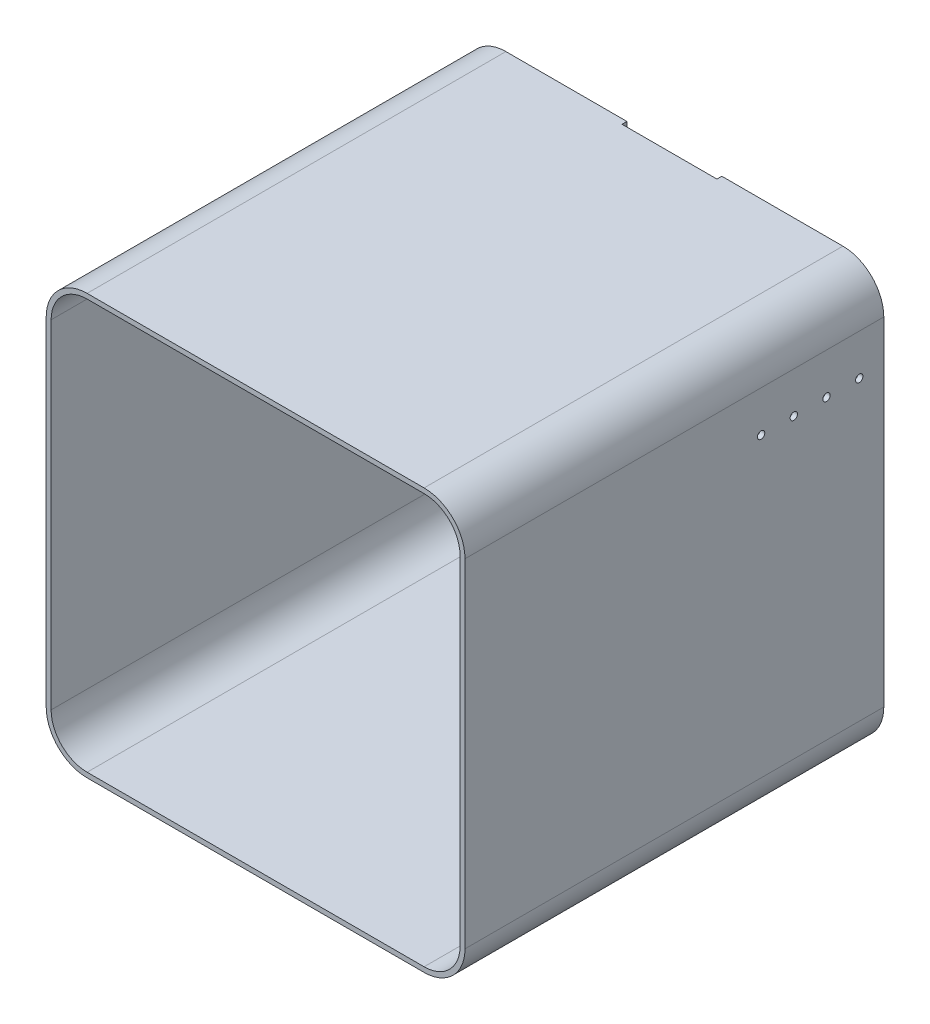
ISO-10303-21;
HEADER;
FILE_DESCRIPTION(('STEP AP214'),'2;1');
FILE_NAME('part.step','',(''),(''),'','','');
FILE_SCHEMA(('AUTOMOTIVE_DESIGN { 1 0 10303 214 1 1 1 1 }'));
ENDSEC;
DATA;
#1=APPLICATION_CONTEXT('core data for automotive mechanical design processes');
#2=APPLICATION_PROTOCOL_DEFINITION('international standard','automotive_design',2000,#1);
#3=PRODUCT_CONTEXT('',#1,'mechanical');
#4=PRODUCT('Part','Part','',(#3));
#5=PRODUCT_RELATED_PRODUCT_CATEGORY('part','',(#4));
#6=PRODUCT_DEFINITION_FORMATION('','',#4);
#7=PRODUCT_DEFINITION_CONTEXT('part definition',#1,'design');
#8=PRODUCT_DEFINITION('design','',#6,#7);
#9=PRODUCT_DEFINITION_SHAPE('','',#8);
#10=(LENGTH_UNIT() NAMED_UNIT(*) SI_UNIT(.MILLI.,.METRE.));
#11=(NAMED_UNIT(*) PLANE_ANGLE_UNIT() SI_UNIT($,.RADIAN.));
#12=(NAMED_UNIT(*) SI_UNIT($,.STERADIAN.) SOLID_ANGLE_UNIT());
#13=UNCERTAINTY_MEASURE_WITH_UNIT(LENGTH_MEASURE(1.E-05),#10,'distance_accuracy_value','');
#14=(GEOMETRIC_REPRESENTATION_CONTEXT(3) GLOBAL_UNCERTAINTY_ASSIGNED_CONTEXT((#13)) GLOBAL_UNIT_ASSIGNED_CONTEXT((#10,
#11,#12)) REPRESENTATION_CONTEXT('',''));
#15=CARTESIAN_POINT('',(0.,0.,0.));
#16=DIRECTION('',(0.,0.,1.));
#17=DIRECTION('',(1.,0.,0.));
#18=AXIS2_PLACEMENT_3D('',#15,#16,#17);
#19=CARTESIAN_POINT('',(496.,407.,-362.));
#20=DIRECTION('',(1.,0.,0.));
#21=DIRECTION('',(0.,1.,0.));
#22=AXIS2_PLACEMENT_3D('',#19,#20,#21);
#23=CYLINDRICAL_SURFACE('',#22,4.50000000000002);
#24=CARTESIAN_POINT('',(506.,407.,-362.));
#25=DIRECTION('',(1.,0.,0.));
#26=DIRECTION('',(0.,1.,0.));
#27=AXIS2_PLACEMENT_3D('',#24,#25,#26);
#28=CIRCLE('',#27,4.50000000000002);
#29=CARTESIAN_POINT('',(506.,411.5,-362.));
#30=VERTEX_POINT('',#29);
#31=EDGE_CURVE('E89',#30,#30,#28,.T.);
#32=ORIENTED_EDGE('',*,*,#31,.T.);
#33=EDGE_LOOP('',(#32));
#34=FACE_BOUND('',#33,.T.);
#35=CARTESIAN_POINT('',(500.,407.,-362.));
#36=DIRECTION('',(1.,0.,0.));
#37=DIRECTION('',(0.,1.,0.));
#38=AXIS2_PLACEMENT_3D('',#35,#36,#37);
#39=CIRCLE('',#38,4.50000000000002);
#40=CARTESIAN_POINT('',(500.,411.5,-362.));
#41=VERTEX_POINT('',#40);
#42=EDGE_CURVE('E12',#41,#41,#39,.T.);
#43=ORIENTED_EDGE('',*,*,#42,.F.);
#44=EDGE_LOOP('',(#43));
#45=FACE_BOUND('',#44,.T.);
#46=ADVANCED_FACE('F82',(#34,#45),#23,.F.);
#47=CARTESIAN_POINT('',(496.,407.,-402.));
#48=DIRECTION('',(1.,0.,0.));
#49=DIRECTION('',(0.,1.,0.));
#50=AXIS2_PLACEMENT_3D('',#47,#48,#49);
#51=CYLINDRICAL_SURFACE('',#50,4.50000000000002);
#52=CARTESIAN_POINT('',(506.,407.,-402.));
#53=DIRECTION('',(1.,0.,0.));
#54=DIRECTION('',(0.,1.,0.));
#55=AXIS2_PLACEMENT_3D('',#52,#53,#54);
#56=CIRCLE('',#55,4.50000000000002);
#57=CARTESIAN_POINT('',(506.,411.5,-402.));
#58=VERTEX_POINT('',#57);
#59=EDGE_CURVE('E378',#58,#58,#56,.T.);
#60=ORIENTED_EDGE('',*,*,#59,.T.);
#61=EDGE_LOOP('',(#60));
#62=FACE_BOUND('',#61,.T.);
#63=CARTESIAN_POINT('',(500.,407.,-402.));
#64=DIRECTION('',(1.,0.,0.));
#65=DIRECTION('',(0.,1.,0.));
#66=AXIS2_PLACEMENT_3D('',#63,#64,#65);
#67=CIRCLE('',#66,4.50000000000002);
#68=CARTESIAN_POINT('',(500.,411.5,-402.));
#69=VERTEX_POINT('',#68);
#70=EDGE_CURVE('E383',#69,#69,#67,.T.);
#71=ORIENTED_EDGE('',*,*,#70,.F.);
#72=EDGE_LOOP('',(#71));
#73=FACE_BOUND('',#72,.T.);
#74=ADVANCED_FACE('F411',(#62,#73),#51,.F.);
#75=CARTESIAN_POINT('',(44.,457.,-512.));
#76=DIRECTION('',(0.,0.,-1.));
#77=DIRECTION('',(-1.,0.,0.));
#78=AXIS2_PLACEMENT_3D('',#75,#76,#77);
#79=PLANE('',#78);
#80=DIRECTION('',(0.,-1.,0.));
#81=VECTOR('',#80,1.);
#82=CARTESIAN_POINT('',(308.,507.,-512.));
#83=LINE('',#82,#81);
#84=CARTESIAN_POINT('',(308.,507.,-512.));
#85=VERTEX_POINT('',#84);
#86=CARTESIAN_POINT('',(308.,501.,-512.));
#87=VERTEX_POINT('',#86);
#88=EDGE_CURVE('E447',#85,#87,#83,.T.);
#89=ORIENTED_EDGE('',*,*,#88,.F.);
#90=DIRECTION('',(1.,0.,0.));
#91=VECTOR('',#90,1.);
#92=CARTESIAN_POINT('',(44.,507.,-512.));
#93=LINE('',#92,#91);
#94=CARTESIAN_POINT('',(456.,507.,-512.));
#95=VERTEX_POINT('',#94);
#96=EDGE_CURVE('E322',#85,#95,#93,.T.);
#97=ORIENTED_EDGE('',*,*,#96,.T.);
#98=CARTESIAN_POINT('',(456.,457.,-512.));
#99=DIRECTION('',(0.,0.,-1.));
#100=DIRECTION('',(-1.,0.,0.));
#101=AXIS2_PLACEMENT_3D('',#98,#99,#100);
#102=CIRCLE('',#101,50.);
#103=CARTESIAN_POINT('',(506.,457.,-512.));
#104=VERTEX_POINT('',#103);
#105=EDGE_CURVE('E326',#95,#104,#102,.T.);
#106=ORIENTED_EDGE('',*,*,#105,.T.);
#107=DIRECTION('',(0.,1.,0.));
#108=VECTOR('',#107,1.);
#109=CARTESIAN_POINT('',(506.,457.,-512.));
#110=LINE('',#109,#108);
#111=CARTESIAN_POINT('',(506.,44.,-512.));
#112=VERTEX_POINT('',#111);
#113=EDGE_CURVE('E328',#112,#104,#110,.T.);
#114=ORIENTED_EDGE('',*,*,#113,.F.);
#115=CARTESIAN_POINT('',(456.,44.,-512.));
#116=DIRECTION('',(0.,0.,-1.));
#117=DIRECTION('',(-1.,0.,0.));
#118=AXIS2_PLACEMENT_3D('',#115,#116,#117);
#119=CIRCLE('',#118,50.);
#120=CARTESIAN_POINT('',(456.,-6.,-512.));
#121=VERTEX_POINT('',#120);
#122=EDGE_CURVE('E331',#121,#112,#119,.F.);
#123=ORIENTED_EDGE('',*,*,#122,.F.);
#124=DIRECTION('',(1.,0.,0.));
#125=VECTOR('',#124,1.);
#126=CARTESIAN_POINT('',(44.,-6.00000000000001,-512.));
#127=LINE('',#126,#125);
#128=CARTESIAN_POINT('',(44.,-6.,-512.));
#129=VERTEX_POINT('',#128);
#130=EDGE_CURVE('E334',#129,#121,#127,.T.);
#131=ORIENTED_EDGE('',*,*,#130,.F.);
#132=CARTESIAN_POINT('',(44.,44.,-512.));
#133=DIRECTION('',(0.,0.,-1.));
#134=DIRECTION('',(-1.,0.,0.));
#135=AXIS2_PLACEMENT_3D('',#132,#133,#134);
#136=CIRCLE('',#135,50.);
#137=CARTESIAN_POINT('',(-6.,44.,-512.));
#138=VERTEX_POINT('',#137);
#139=EDGE_CURVE('E337',#129,#138,#136,.T.);
#140=ORIENTED_EDGE('',*,*,#139,.T.);
#141=DIRECTION('',(0.,1.,0.));
#142=VECTOR('',#141,1.);
#143=CARTESIAN_POINT('',(-6.,457.,-512.));
#144=LINE('',#143,#142);
#145=CARTESIAN_POINT('',(-6.,457.,-512.));
#146=VERTEX_POINT('',#145);
#147=EDGE_CURVE('E316',#138,#146,#144,.T.);
#148=ORIENTED_EDGE('',*,*,#147,.T.);
#149=CARTESIAN_POINT('',(44.,457.,-512.));
#150=DIRECTION('',(0.,0.,-1.));
#151=DIRECTION('',(-1.,0.,0.));
#152=AXIS2_PLACEMENT_3D('',#149,#150,#151);
#153=CIRCLE('',#152,50.);
#154=CARTESIAN_POINT('',(44.,507.,-512.));
#155=VERTEX_POINT('',#154);
#156=EDGE_CURVE('E319',#146,#155,#153,.T.);
#157=ORIENTED_EDGE('',*,*,#156,.T.);
#158=CARTESIAN_POINT('',(192.,507.,-512.));
#159=VERTEX_POINT('',#158);
#160=EDGE_CURVE('E323',#155,#159,#93,.T.);
#161=ORIENTED_EDGE('',*,*,#160,.T.);
#162=DIRECTION('',(0.,1.,0.));
#163=VECTOR('',#162,1.);
#164=CARTESIAN_POINT('',(192.,507.,-512.));
#165=LINE('',#164,#163);
#166=CARTESIAN_POINT('',(192.,501.,-512.));
#167=VERTEX_POINT('',#166);
#168=EDGE_CURVE('E450',#167,#159,#165,.T.);
#169=ORIENTED_EDGE('',*,*,#168,.F.);
#170=DIRECTION('',(1.,0.,0.));
#171=VECTOR('',#170,1.);
#172=CARTESIAN_POINT('',(44.,501.,-512.));
#173=LINE('',#172,#171);
#174=CARTESIAN_POINT('',(44.,501.,-512.));
#175=VERTEX_POINT('',#174);
#176=EDGE_CURVE('E238',#175,#167,#173,.T.);
#177=ORIENTED_EDGE('',*,*,#176,.F.);
#178=CARTESIAN_POINT('',(44.,457.,-512.));
#179=DIRECTION('',(0.,0.,-1.));
#180=DIRECTION('',(-1.,0.,0.));
#181=AXIS2_PLACEMENT_3D('',#178,#179,#180);
#182=CIRCLE('',#181,44.);
#183=CARTESIAN_POINT('',(0.,457.,-512.));
#184=VERTEX_POINT('',#183);
#185=EDGE_CURVE('E258',#184,#175,#182,.T.);
#186=ORIENTED_EDGE('',*,*,#185,.F.);
#187=DIRECTION('',(0.,1.,0.));
#188=VECTOR('',#187,1.);
#189=CARTESIAN_POINT('',(0.,44.,-512.));
#190=LINE('',#189,#188);
#191=CARTESIAN_POINT('',(0.,44.,-512.));
#192=VERTEX_POINT('',#191);
#193=EDGE_CURVE('E256',#192,#184,#190,.T.);
#194=ORIENTED_EDGE('',*,*,#193,.F.);
#195=CARTESIAN_POINT('',(44.,44.,-512.));
#196=DIRECTION('',(0.,0.,-1.));
#197=DIRECTION('',(-1.,0.,0.));
#198=AXIS2_PLACEMENT_3D('',#195,#196,#197);
#199=CIRCLE('',#198,44.);
#200=CARTESIAN_POINT('',(44.,0.,-512.));
#201=VERTEX_POINT('',#200);
#202=EDGE_CURVE('E272',#201,#192,#199,.T.);
#203=ORIENTED_EDGE('',*,*,#202,.F.);
#204=DIRECTION('',(1.,0.,0.));
#205=VECTOR('',#204,1.);
#206=CARTESIAN_POINT('',(44.,0.,-512.));
#207=LINE('',#206,#205);
#208=CARTESIAN_POINT('',(456.,0.,-512.));
#209=VERTEX_POINT('',#208);
#210=EDGE_CURVE('E104',#201,#209,#207,.T.);
#211=ORIENTED_EDGE('',*,*,#210,.T.);
#212=CARTESIAN_POINT('',(456.,44.,-512.));
#213=DIRECTION('',(0.,0.,1.));
#214=DIRECTION('',(1.,0.,0.));
#215=AXIS2_PLACEMENT_3D('',#212,#213,#214);
#216=CIRCLE('',#215,44.);
#217=CARTESIAN_POINT('',(500.,44.,-512.));
#218=VERTEX_POINT('',#217);
#219=EDGE_CURVE('E268',#209,#218,#216,.T.);
#220=ORIENTED_EDGE('',*,*,#219,.T.);
#221=DIRECTION('',(0.,1.,0.));
#222=VECTOR('',#221,1.);
#223=CARTESIAN_POINT('',(500.,44.,-512.));
#224=LINE('',#223,#222);
#225=CARTESIAN_POINT('',(500.,457.,-512.));
#226=VERTEX_POINT('',#225);
#227=EDGE_CURVE('E265',#218,#226,#224,.T.);
#228=ORIENTED_EDGE('',*,*,#227,.T.);
#229=CARTESIAN_POINT('',(456.,457.,-512.));
#230=DIRECTION('',(0.,0.,-1.));
#231=DIRECTION('',(-1.,0.,0.));
#232=AXIS2_PLACEMENT_3D('',#229,#230,#231);
#233=CIRCLE('',#232,44.);
#234=CARTESIAN_POINT('',(456.,501.,-512.));
#235=VERTEX_POINT('',#234);
#236=EDGE_CURVE('E263',#235,#226,#233,.T.);
#237=ORIENTED_EDGE('',*,*,#236,.F.);
#238=EDGE_CURVE('E261',#87,#235,#173,.T.);
#239=ORIENTED_EDGE('',*,*,#238,.F.);
#240=EDGE_LOOP('',(#89,#97,#106,#114,#123,#131,#140,#148,#157,#161,#169,#177,#186,#194,#203,
#211,#220,#228,#237,#239));
#241=FACE_BOUND('',#240,.T.);
#242=ADVANCED_FACE('F416',(#241),#79,.T.);
#243=CARTESIAN_POINT('',(44.,457.,0.));
#244=DIRECTION('',(0.,0.,-1.));
#245=DIRECTION('',(-1.,0.,0.));
#246=AXIS2_PLACEMENT_3D('',#243,#244,#245);
#247=PLANE('',#246);
#248=DIRECTION('',(0.,1.,0.));
#249=VECTOR('',#248,1.);
#250=CARTESIAN_POINT('',(-6.,457.,0.));
#251=LINE('',#250,#249);
#252=CARTESIAN_POINT('',(-6.,44.,0.));
#253=VERTEX_POINT('',#252);
#254=CARTESIAN_POINT('',(-6.,457.,0.));
#255=VERTEX_POINT('',#254);
#256=EDGE_CURVE('E315',#253,#255,#251,.T.);
#257=ORIENTED_EDGE('',*,*,#256,.F.);
#258=CARTESIAN_POINT('',(44.,44.,0.));
#259=DIRECTION('',(0.,0.,-1.));
#260=DIRECTION('',(-1.,0.,0.));
#261=AXIS2_PLACEMENT_3D('',#258,#259,#260);
#262=CIRCLE('',#261,50.);
#263=CARTESIAN_POINT('',(44.,-6.,0.));
#264=VERTEX_POINT('',#263);
#265=EDGE_CURVE('E320',#264,#253,#262,.T.);
#266=ORIENTED_EDGE('',*,*,#265,.F.);
#267=DIRECTION('',(1.,0.,0.));
#268=VECTOR('',#267,1.);
#269=CARTESIAN_POINT('',(44.,-6.00000000000001,0.));
#270=LINE('',#269,#268);
#271=CARTESIAN_POINT('',(456.,-6.,0.));
#272=VERTEX_POINT('',#271);
#273=EDGE_CURVE('E355',#264,#272,#270,.T.);
#274=ORIENTED_EDGE('',*,*,#273,.T.);
#275=CARTESIAN_POINT('',(456.,44.,0.));
#276=DIRECTION('',(0.,0.,-1.));
#277=DIRECTION('',(-1.,0.,0.));
#278=AXIS2_PLACEMENT_3D('',#275,#276,#277);
#279=CIRCLE('',#278,50.);
#280=CARTESIAN_POINT('',(506.,44.,0.));
#281=VERTEX_POINT('',#280);
#282=EDGE_CURVE('E352',#272,#281,#279,.F.);
#283=ORIENTED_EDGE('',*,*,#282,.T.);
#284=DIRECTION('',(0.,1.,0.));
#285=VECTOR('',#284,1.);
#286=CARTESIAN_POINT('',(506.,457.,0.));
#287=LINE('',#286,#285);
#288=CARTESIAN_POINT('',(506.,457.,0.));
#289=VERTEX_POINT('',#288);
#290=EDGE_CURVE('E349',#281,#289,#287,.T.);
#291=ORIENTED_EDGE('',*,*,#290,.T.);
#292=CARTESIAN_POINT('',(456.,457.,0.));
#293=DIRECTION('',(0.,0.,-1.));
#294=DIRECTION('',(-1.,0.,0.));
#295=AXIS2_PLACEMENT_3D('',#292,#293,#294);
#296=CIRCLE('',#295,50.);
#297=CARTESIAN_POINT('',(456.,507.,0.));
#298=VERTEX_POINT('',#297);
#299=EDGE_CURVE('E346',#298,#289,#296,.T.);
#300=ORIENTED_EDGE('',*,*,#299,.F.);
#301=DIRECTION('',(1.,0.,0.));
#302=VECTOR('',#301,1.);
#303=CARTESIAN_POINT('',(44.,507.,0.));
#304=LINE('',#303,#302);
#305=CARTESIAN_POINT('',(44.,507.,0.));
#306=VERTEX_POINT('',#305);
#307=EDGE_CURVE('E344',#306,#298,#304,.T.);
#308=ORIENTED_EDGE('',*,*,#307,.F.);
#309=CARTESIAN_POINT('',(44.,457.,0.));
#310=DIRECTION('',(0.,0.,-1.));
#311=DIRECTION('',(-1.,0.,0.));
#312=AXIS2_PLACEMENT_3D('',#309,#310,#311);
#313=CIRCLE('',#312,50.);
#314=EDGE_CURVE('E342',#255,#306,#313,.T.);
#315=ORIENTED_EDGE('',*,*,#314,.F.);
#316=EDGE_LOOP('',(#257,#266,#274,#283,#291,#300,#308,#315));
#317=FACE_BOUND('',#316,.T.);
#318=DIRECTION('',(0.,1.,0.));
#319=VECTOR('',#318,1.);
#320=CARTESIAN_POINT('',(0.,44.,0.));
#321=LINE('',#320,#319);
#322=CARTESIAN_POINT('',(0.,44.,0.));
#323=VERTEX_POINT('',#322);
#324=CARTESIAN_POINT('',(0.,457.,0.));
#325=VERTEX_POINT('',#324);
#326=EDGE_CURVE('E275',#323,#325,#321,.T.);
#327=ORIENTED_EDGE('',*,*,#326,.T.);
#328=CARTESIAN_POINT('',(44.,457.,0.));
#329=DIRECTION('',(0.,0.,-1.));
#330=DIRECTION('',(-1.,0.,0.));
#331=AXIS2_PLACEMENT_3D('',#328,#329,#330);
#332=CIRCLE('',#331,44.);
#333=CARTESIAN_POINT('',(44.,501.,0.));
#334=VERTEX_POINT('',#333);
#335=EDGE_CURVE('E278',#325,#334,#332,.T.);
#336=ORIENTED_EDGE('',*,*,#335,.T.);
#337=DIRECTION('',(1.,0.,0.));
#338=VECTOR('',#337,1.);
#339=CARTESIAN_POINT('',(44.,501.,0.));
#340=LINE('',#339,#338);
#341=CARTESIAN_POINT('',(456.,501.,0.));
#342=VERTEX_POINT('',#341);
#343=EDGE_CURVE('E281',#334,#342,#340,.T.);
#344=ORIENTED_EDGE('',*,*,#343,.T.);
#345=CARTESIAN_POINT('',(456.,457.,0.));
#346=DIRECTION('',(0.,0.,-1.));
#347=DIRECTION('',(-1.,0.,0.));
#348=AXIS2_PLACEMENT_3D('',#345,#346,#347);
#349=CIRCLE('',#348,44.);
#350=CARTESIAN_POINT('',(500.,457.,0.));
#351=VERTEX_POINT('',#350);
#352=EDGE_CURVE('E284',#342,#351,#349,.T.);
#353=ORIENTED_EDGE('',*,*,#352,.T.);
#354=DIRECTION('',(0.,1.,0.));
#355=VECTOR('',#354,1.);
#356=CARTESIAN_POINT('',(500.,44.,0.));
#357=LINE('',#356,#355);
#358=CARTESIAN_POINT('',(500.,44.,0.));
#359=VERTEX_POINT('',#358);
#360=EDGE_CURVE('E287',#359,#351,#357,.T.);
#361=ORIENTED_EDGE('',*,*,#360,.F.);
#362=CARTESIAN_POINT('',(456.,44.,0.));
#363=DIRECTION('',(0.,0.,1.));
#364=DIRECTION('',(1.,0.,0.));
#365=AXIS2_PLACEMENT_3D('',#362,#363,#364);
#366=CIRCLE('',#365,44.);
#367=CARTESIAN_POINT('',(456.,0.,0.));
#368=VERTEX_POINT('',#367);
#369=EDGE_CURVE('E290',#368,#359,#366,.T.);
#370=ORIENTED_EDGE('',*,*,#369,.F.);
#371=DIRECTION('',(1.,0.,0.));
#372=VECTOR('',#371,1.);
#373=CARTESIAN_POINT('',(44.,0.,0.));
#374=LINE('',#373,#372);
#375=CARTESIAN_POINT('',(44.,0.,0.));
#376=VERTEX_POINT('',#375);
#377=EDGE_CURVE('E293',#376,#368,#374,.T.);
#378=ORIENTED_EDGE('',*,*,#377,.F.);
#379=CARTESIAN_POINT('',(44.,44.,0.));
#380=DIRECTION('',(0.,0.,-1.));
#381=DIRECTION('',(-1.,0.,0.));
#382=AXIS2_PLACEMENT_3D('',#379,#380,#381);
#383=CIRCLE('',#382,44.);
#384=EDGE_CURVE('E259',#376,#323,#383,.T.);
#385=ORIENTED_EDGE('',*,*,#384,.T.);
#386=EDGE_LOOP('',(#327,#336,#344,#353,#361,#370,#378,#385));
#387=FACE_BOUND('',#386,.T.);
#388=ADVANCED_FACE('F421',(#317,#387),#247,.F.);
#389=CARTESIAN_POINT('',(-6.,457.,-512.));
#390=DIRECTION('',(1.,0.,0.));
#391=DIRECTION('',(0.,1.,0.));
#392=AXIS2_PLACEMENT_3D('',#389,#390,#391);
#393=PLANE('',#392);
#394=ORIENTED_EDGE('',*,*,#256,.T.);
#395=DIRECTION('',(0.,0.,1.));
#396=VECTOR('',#395,1.);
#397=CARTESIAN_POINT('',(-6.,457.,-512.));
#398=LINE('',#397,#396);
#399=EDGE_CURVE('E375',#146,#255,#398,.T.);
#400=ORIENTED_EDGE('',*,*,#399,.F.);
#401=ORIENTED_EDGE('',*,*,#147,.F.);
#402=DIRECTION('',(0.,0.,1.));
#403=VECTOR('',#402,1.);
#404=CARTESIAN_POINT('',(-6.,44.,-512.));
#405=LINE('',#404,#403);
#406=EDGE_CURVE('E339',#138,#253,#405,.T.);
#407=ORIENTED_EDGE('',*,*,#406,.T.);
#408=EDGE_LOOP('',(#394,#400,#401,#407));
#409=FACE_BOUND('',#408,.T.);
#410=ADVANCED_FACE('F426',(#409),#393,.F.);
#411=CARTESIAN_POINT('',(44.,457.,-512.));
#412=DIRECTION('',(0.,0.,1.));
#413=DIRECTION('',(1.,0.,0.));
#414=AXIS2_PLACEMENT_3D('',#411,#412,#413);
#415=CYLINDRICAL_SURFACE('',#414,50.);
#416=ORIENTED_EDGE('',*,*,#314,.T.);
#417=DIRECTION('',(0.,0.,1.));
#418=VECTOR('',#417,1.);
#419=CARTESIAN_POINT('',(44.,507.,-512.));
#420=LINE('',#419,#418);
#421=EDGE_CURVE('E372',#155,#306,#420,.T.);
#422=ORIENTED_EDGE('',*,*,#421,.F.);
#423=ORIENTED_EDGE('',*,*,#156,.F.);
#424=ORIENTED_EDGE('',*,*,#399,.T.);
#425=EDGE_LOOP('',(#416,#422,#423,#424));
#426=FACE_BOUND('',#425,.T.);
#427=ADVANCED_FACE('F429',(#426),#415,.T.);
#428=CARTESIAN_POINT('',(44.,507.,-512.));
#429=DIRECTION('',(0.,-1.,0.));
#430=DIRECTION('',(0.,0.,-1.));
#431=AXIS2_PLACEMENT_3D('',#428,#429,#430);
#432=PLANE('',#431);
#433=ORIENTED_EDGE('',*,*,#96,.F.);
#434=DIRECTION('',(0.,0.,-1.));
#435=VECTOR('',#434,1.);
#436=CARTESIAN_POINT('',(308.,507.,-506.));
#437=LINE('',#436,#435);
#438=CARTESIAN_POINT('',(308.,507.,-506.));
#439=VERTEX_POINT('',#438);
#440=EDGE_CURVE('E241',#439,#85,#437,.T.);
#441=ORIENTED_EDGE('',*,*,#440,.F.);
#442=DIRECTION('',(1.,0.,0.));
#443=VECTOR('',#442,1.);
#444=CARTESIAN_POINT('',(308.,507.,-506.));
#445=LINE('',#444,#443);
#446=CARTESIAN_POINT('',(192.,507.,-506.));
#447=VERTEX_POINT('',#446);
#448=EDGE_CURVE('E226',#447,#439,#445,.T.);
#449=ORIENTED_EDGE('',*,*,#448,.F.);
#450=DIRECTION('',(0.,0.,-1.));
#451=VECTOR('',#450,1.);
#452=CARTESIAN_POINT('',(192.,507.,-506.));
#453=LINE('',#452,#451);
#454=EDGE_CURVE('E224',#447,#159,#453,.T.);
#455=ORIENTED_EDGE('',*,*,#454,.T.);
#456=ORIENTED_EDGE('',*,*,#160,.F.);
#457=ORIENTED_EDGE('',*,*,#421,.T.);
#458=ORIENTED_EDGE('',*,*,#307,.T.);
#459=DIRECTION('',(0.,0.,1.));
#460=VECTOR('',#459,1.);
#461=CARTESIAN_POINT('',(456.,507.,-512.));
#462=LINE('',#461,#460);
#463=EDGE_CURVE('E369',#95,#298,#462,.T.);
#464=ORIENTED_EDGE('',*,*,#463,.F.);
#465=EDGE_LOOP('',(#433,#441,#449,#455,#456,#457,#458,#464));
#466=FACE_BOUND('',#465,.T.);
#467=ADVANCED_FACE('F405',(#466),#432,.F.);
#468=CARTESIAN_POINT('',(456.,457.,-512.));
#469=DIRECTION('',(0.,0.,1.));
#470=DIRECTION('',(1.,0.,0.));
#471=AXIS2_PLACEMENT_3D('',#468,#469,#470);
#472=CYLINDRICAL_SURFACE('',#471,50.);
#473=ORIENTED_EDGE('',*,*,#299,.T.);
#474=DIRECTION('',(0.,0.,1.));
#475=VECTOR('',#474,1.);
#476=CARTESIAN_POINT('',(506.,457.,-512.));
#477=LINE('',#476,#475);
#478=EDGE_CURVE('E367',#104,#289,#477,.T.);
#479=ORIENTED_EDGE('',*,*,#478,.F.);
#480=ORIENTED_EDGE('',*,*,#105,.F.);
#481=ORIENTED_EDGE('',*,*,#463,.T.);
#482=EDGE_LOOP('',(#473,#479,#480,#481));
#483=FACE_BOUND('',#482,.T.);
#484=ADVANCED_FACE('F393',(#483),#472,.T.);
#485=CARTESIAN_POINT('',(506.,457.,-512.));
#486=DIRECTION('',(1.,0.,0.));
#487=DIRECTION('',(0.,1.,0.));
#488=AXIS2_PLACEMENT_3D('',#485,#486,#487);
#489=PLANE('',#488);
#490=CARTESIAN_POINT('',(506.,407.,-442.));
#491=DIRECTION('',(1.,0.,0.));
#492=DIRECTION('',(0.,1.,0.));
#493=AXIS2_PLACEMENT_3D('',#490,#491,#492);
#494=CIRCLE('',#493,4.50000000000002);
#495=CARTESIAN_POINT('',(506.,411.5,-442.));
#496=VERTEX_POINT('',#495);
#497=EDGE_CURVE('E246',#496,#496,#494,.T.);
#498=ORIENTED_EDGE('',*,*,#497,.F.);
#499=EDGE_LOOP('',(#498));
#500=FACE_BOUND('',#499,.T.);
#501=CARTESIAN_POINT('',(506.,407.,-482.));
#502=DIRECTION('',(1.,0.,0.));
#503=DIRECTION('',(0.,1.,0.));
#504=AXIS2_PLACEMENT_3D('',#501,#502,#503);
#505=CIRCLE('',#504,4.50000000000002);
#506=CARTESIAN_POINT('',(506.,411.5,-482.));
#507=VERTEX_POINT('',#506);
#508=EDGE_CURVE('E252',#507,#507,#505,.T.);
#509=ORIENTED_EDGE('',*,*,#508,.F.);
#510=EDGE_LOOP('',(#509));
#511=FACE_BOUND('',#510,.T.);
#512=ORIENTED_EDGE('',*,*,#290,.F.);
#513=DIRECTION('',(0.,0.,1.));
#514=VECTOR('',#513,1.);
#515=CARTESIAN_POINT('',(506.,44.,-512.));
#516=LINE('',#515,#514);
#517=EDGE_CURVE('E365',#112,#281,#516,.T.);
#518=ORIENTED_EDGE('',*,*,#517,.F.);
#519=ORIENTED_EDGE('',*,*,#113,.T.);
#520=ORIENTED_EDGE('',*,*,#478,.T.);
#521=EDGE_LOOP('',(#512,#518,#519,#520));
#522=FACE_BOUND('',#521,.T.);
#523=ORIENTED_EDGE('',*,*,#59,.F.);
#524=EDGE_LOOP('',(#523));
#525=FACE_BOUND('',#524,.T.);
#526=ORIENTED_EDGE('',*,*,#31,.F.);
#527=EDGE_LOOP('',(#526));
#528=FACE_BOUND('',#527,.T.);
#529=ADVANCED_FACE('F390',(#500,#511,#522,#525,#528),#489,.T.);
#530=CARTESIAN_POINT('',(456.,44.,-512.));
#531=DIRECTION('',(0.,0.,1.));
#532=DIRECTION('',(1.,0.,0.));
#533=AXIS2_PLACEMENT_3D('',#530,#531,#532);
#534=CYLINDRICAL_SURFACE('',#533,50.);
#535=ORIENTED_EDGE('',*,*,#282,.F.);
#536=DIRECTION('',(0.,0.,1.));
#537=VECTOR('',#536,1.);
#538=CARTESIAN_POINT('',(456.,-6.,-512.));
#539=LINE('',#538,#537);
#540=EDGE_CURVE('E363',#121,#272,#539,.T.);
#541=ORIENTED_EDGE('',*,*,#540,.F.);
#542=ORIENTED_EDGE('',*,*,#122,.T.);
#543=ORIENTED_EDGE('',*,*,#517,.T.);
#544=EDGE_LOOP('',(#535,#541,#542,#543));
#545=FACE_BOUND('',#544,.T.);
#546=ADVANCED_FACE('F392',(#545),#534,.T.);
#547=CARTESIAN_POINT('',(44.,-6.00000000000001,-512.));
#548=DIRECTION('',(0.,-1.,0.));
#549=DIRECTION('',(0.,0.,-1.));
#550=AXIS2_PLACEMENT_3D('',#547,#548,#549);
#551=PLANE('',#550);
#552=ORIENTED_EDGE('',*,*,#273,.F.);
#553=DIRECTION('',(0.,0.,1.));
#554=VECTOR('',#553,1.);
#555=CARTESIAN_POINT('',(44.,-6.,-512.));
#556=LINE('',#555,#554);
#557=EDGE_CURVE('E361',#129,#264,#556,.T.);
#558=ORIENTED_EDGE('',*,*,#557,.F.);
#559=ORIENTED_EDGE('',*,*,#130,.T.);
#560=ORIENTED_EDGE('',*,*,#540,.T.);
#561=EDGE_LOOP('',(#552,#558,#559,#560));
#562=FACE_BOUND('',#561,.T.);
#563=ADVANCED_FACE('F401',(#562),#551,.T.);
#564=CARTESIAN_POINT('',(44.,44.,-512.));
#565=DIRECTION('',(0.,0.,1.));
#566=DIRECTION('',(1.,0.,0.));
#567=AXIS2_PLACEMENT_3D('',#564,#565,#566);
#568=CYLINDRICAL_SURFACE('',#567,50.);
#569=ORIENTED_EDGE('',*,*,#265,.T.);
#570=ORIENTED_EDGE('',*,*,#406,.F.);
#571=ORIENTED_EDGE('',*,*,#139,.F.);
#572=ORIENTED_EDGE('',*,*,#557,.T.);
#573=EDGE_LOOP('',(#569,#570,#571,#572));
#574=FACE_BOUND('',#573,.T.);
#575=ADVANCED_FACE('F476',(#574),#568,.T.);
#576=CARTESIAN_POINT('',(0.,44.,-512.));
#577=DIRECTION('',(1.,0.,0.));
#578=DIRECTION('',(0.,1.,0.));
#579=AXIS2_PLACEMENT_3D('',#576,#577,#578);
#580=PLANE('',#579);
#581=ORIENTED_EDGE('',*,*,#326,.F.);
#582=DIRECTION('',(0.,0.,1.));
#583=VECTOR('',#582,1.);
#584=CARTESIAN_POINT('',(0.,44.,-512.));
#585=LINE('',#584,#583);
#586=EDGE_CURVE('E274',#192,#323,#585,.T.);
#587=ORIENTED_EDGE('',*,*,#586,.F.);
#588=ORIENTED_EDGE('',*,*,#193,.T.);
#589=DIRECTION('',(0.,0.,1.));
#590=VECTOR('',#589,1.);
#591=CARTESIAN_POINT('',(0.,457.,-512.));
#592=LINE('',#591,#590);
#593=EDGE_CURVE('E312',#184,#325,#592,.T.);
#594=ORIENTED_EDGE('',*,*,#593,.T.);
#595=EDGE_LOOP('',(#581,#587,#588,#594));
#596=FACE_BOUND('',#595,.T.);
#597=ADVANCED_FACE('F479',(#596),#580,.T.);
#598=CARTESIAN_POINT('',(44.,457.,-512.));
#599=DIRECTION('',(0.,0.,1.));
#600=DIRECTION('',(1.,0.,0.));
#601=AXIS2_PLACEMENT_3D('',#598,#599,#600);
#602=CYLINDRICAL_SURFACE('',#601,44.);
#603=ORIENTED_EDGE('',*,*,#335,.F.);
#604=ORIENTED_EDGE('',*,*,#593,.F.);
#605=ORIENTED_EDGE('',*,*,#185,.T.);
#606=DIRECTION('',(0.,0.,1.));
#607=VECTOR('',#606,1.);
#608=CARTESIAN_POINT('',(44.,501.,-512.));
#609=LINE('',#608,#607);
#610=EDGE_CURVE('E310',#175,#334,#609,.T.);
#611=ORIENTED_EDGE('',*,*,#610,.T.);
#612=EDGE_LOOP('',(#603,#604,#605,#611));
#613=FACE_BOUND('',#612,.T.);
#614=ADVANCED_FACE('F485',(#613),#602,.F.);
#615=CARTESIAN_POINT('',(44.,501.,-512.));
#616=DIRECTION('',(0.,-1.,0.));
#617=DIRECTION('',(0.,0.,-1.));
#618=AXIS2_PLACEMENT_3D('',#615,#616,#617);
#619=PLANE('',#618);
#620=DIRECTION('',(0.,0.,-1.));
#621=VECTOR('',#620,1.);
#622=CARTESIAN_POINT('',(308.,501.,-506.));
#623=LINE('',#622,#621);
#624=CARTESIAN_POINT('',(308.,501.,-506.));
#625=VERTEX_POINT('',#624);
#626=EDGE_CURVE('E239',#625,#87,#623,.T.);
#627=ORIENTED_EDGE('',*,*,#626,.T.);
#628=ORIENTED_EDGE('',*,*,#238,.T.);
#629=DIRECTION('',(0.,0.,1.));
#630=VECTOR('',#629,1.);
#631=CARTESIAN_POINT('',(456.,501.,-512.));
#632=LINE('',#631,#630);
#633=EDGE_CURVE('E308',#235,#342,#632,.T.);
#634=ORIENTED_EDGE('',*,*,#633,.T.);
#635=ORIENTED_EDGE('',*,*,#343,.F.);
#636=ORIENTED_EDGE('',*,*,#610,.F.);
#637=ORIENTED_EDGE('',*,*,#176,.T.);
#638=DIRECTION('',(0.,0.,-1.));
#639=VECTOR('',#638,1.);
#640=CARTESIAN_POINT('',(192.,501.,-506.));
#641=LINE('',#640,#639);
#642=CARTESIAN_POINT('',(192.,501.,-506.));
#643=VERTEX_POINT('',#642);
#644=EDGE_CURVE('E221',#643,#167,#641,.T.);
#645=ORIENTED_EDGE('',*,*,#644,.F.);
#646=DIRECTION('',(-1.,0.,0.));
#647=VECTOR('',#646,1.);
#648=CARTESIAN_POINT('',(308.,501.,-506.));
#649=LINE('',#648,#647);
#650=EDGE_CURVE('E227',#625,#643,#649,.T.);
#651=ORIENTED_EDGE('',*,*,#650,.F.);
#652=EDGE_LOOP('',(#627,#628,#634,#635,#636,#637,#645,#651));
#653=FACE_BOUND('',#652,.T.);
#654=ADVANCED_FACE('F235',(#653),#619,.T.);
#655=CARTESIAN_POINT('',(456.,457.,-512.));
#656=DIRECTION('',(0.,0.,1.));
#657=DIRECTION('',(1.,0.,0.));
#658=AXIS2_PLACEMENT_3D('',#655,#656,#657);
#659=CYLINDRICAL_SURFACE('',#658,44.);
#660=ORIENTED_EDGE('',*,*,#352,.F.);
#661=ORIENTED_EDGE('',*,*,#633,.F.);
#662=ORIENTED_EDGE('',*,*,#236,.T.);
#663=DIRECTION('',(0.,0.,1.));
#664=VECTOR('',#663,1.);
#665=CARTESIAN_POINT('',(500.,457.,-512.));
#666=LINE('',#665,#664);
#667=EDGE_CURVE('E306',#226,#351,#666,.T.);
#668=ORIENTED_EDGE('',*,*,#667,.T.);
#669=EDGE_LOOP('',(#660,#661,#662,#668));
#670=FACE_BOUND('',#669,.T.);
#671=ADVANCED_FACE('F496',(#670),#659,.F.);
#672=CARTESIAN_POINT('',(500.,44.,-512.));
#673=DIRECTION('',(1.,0.,0.));
#674=DIRECTION('',(0.,1.,0.));
#675=AXIS2_PLACEMENT_3D('',#672,#673,#674);
#676=PLANE('',#675);
#677=CARTESIAN_POINT('',(500.,407.,-442.));
#678=DIRECTION('',(1.,0.,0.));
#679=DIRECTION('',(0.,1.,0.));
#680=AXIS2_PLACEMENT_3D('',#677,#678,#679);
#681=CIRCLE('',#680,4.50000000000002);
#682=CARTESIAN_POINT('',(500.,411.5,-442.));
#683=VERTEX_POINT('',#682);
#684=EDGE_CURVE('E249',#683,#683,#681,.T.);
#685=ORIENTED_EDGE('',*,*,#684,.T.);
#686=EDGE_LOOP('',(#685));
#687=FACE_BOUND('',#686,.T.);
#688=CARTESIAN_POINT('',(500.,407.,-482.));
#689=DIRECTION('',(1.,0.,0.));
#690=DIRECTION('',(0.,1.,0.));
#691=AXIS2_PLACEMENT_3D('',#688,#689,#690);
#692=CIRCLE('',#691,4.50000000000002);
#693=CARTESIAN_POINT('',(500.,411.5,-482.));
#694=VERTEX_POINT('',#693);
#695=EDGE_CURVE('E255',#694,#694,#692,.T.);
#696=ORIENTED_EDGE('',*,*,#695,.T.);
#697=EDGE_LOOP('',(#696));
#698=FACE_BOUND('',#697,.T.);
#699=ORIENTED_EDGE('',*,*,#360,.T.);
#700=ORIENTED_EDGE('',*,*,#667,.F.);
#701=ORIENTED_EDGE('',*,*,#227,.F.);
#702=DIRECTION('',(0.,0.,1.));
#703=VECTOR('',#702,1.);
#704=CARTESIAN_POINT('',(500.,44.,-512.));
#705=LINE('',#704,#703);
#706=EDGE_CURVE('E304',#218,#359,#705,.T.);
#707=ORIENTED_EDGE('',*,*,#706,.T.);
#708=EDGE_LOOP('',(#699,#700,#701,#707));
#709=FACE_BOUND('',#708,.T.);
#710=ORIENTED_EDGE('',*,*,#70,.T.);
#711=EDGE_LOOP('',(#710));
#712=FACE_BOUND('',#711,.T.);
#713=ORIENTED_EDGE('',*,*,#42,.T.);
#714=EDGE_LOOP('',(#713));
#715=FACE_BOUND('',#714,.T.);
#716=ADVANCED_FACE('F499',(#687,#698,#709,#712,#715),#676,.F.);
#717=CARTESIAN_POINT('',(456.,44.,-512.));
#718=DIRECTION('',(0.,0.,1.));
#719=DIRECTION('',(1.,0.,0.));
#720=AXIS2_PLACEMENT_3D('',#717,#718,#719);
#721=CYLINDRICAL_SURFACE('',#720,44.);
#722=ORIENTED_EDGE('',*,*,#369,.T.);
#723=ORIENTED_EDGE('',*,*,#706,.F.);
#724=ORIENTED_EDGE('',*,*,#219,.F.);
#725=DIRECTION('',(0.,0.,1.));
#726=VECTOR('',#725,1.);
#727=CARTESIAN_POINT('',(456.,0.,-512.));
#728=LINE('',#727,#726);
#729=EDGE_CURVE('E302',#209,#368,#728,.T.);
#730=ORIENTED_EDGE('',*,*,#729,.T.);
#731=EDGE_LOOP('',(#722,#723,#724,#730));
#732=FACE_BOUND('',#731,.T.);
#733=ADVANCED_FACE('F502',(#732),#721,.F.);
#734=CARTESIAN_POINT('',(44.,0.,-512.));
#735=DIRECTION('',(0.,-1.,0.));
#736=DIRECTION('',(0.,0.,-1.));
#737=AXIS2_PLACEMENT_3D('',#734,#735,#736);
#738=PLANE('',#737);
#739=ORIENTED_EDGE('',*,*,#377,.T.);
#740=ORIENTED_EDGE('',*,*,#729,.F.);
#741=ORIENTED_EDGE('',*,*,#210,.F.);
#742=DIRECTION('',(0.,0.,1.));
#743=VECTOR('',#742,1.);
#744=CARTESIAN_POINT('',(44.,0.,-512.));
#745=LINE('',#744,#743);
#746=EDGE_CURVE('E300',#201,#376,#745,.T.);
#747=ORIENTED_EDGE('',*,*,#746,.T.);
#748=EDGE_LOOP('',(#739,#740,#741,#747));
#749=FACE_BOUND('',#748,.T.);
#750=ADVANCED_FACE('F506',(#749),#738,.F.);
#751=CARTESIAN_POINT('',(44.,44.,-512.));
#752=DIRECTION('',(0.,0.,1.));
#753=DIRECTION('',(1.,0.,0.));
#754=AXIS2_PLACEMENT_3D('',#751,#752,#753);
#755=CYLINDRICAL_SURFACE('',#754,44.);
#756=ORIENTED_EDGE('',*,*,#384,.F.);
#757=ORIENTED_EDGE('',*,*,#746,.F.);
#758=ORIENTED_EDGE('',*,*,#202,.T.);
#759=ORIENTED_EDGE('',*,*,#586,.T.);
#760=EDGE_LOOP('',(#756,#757,#758,#759));
#761=FACE_BOUND('',#760,.T.);
#762=ADVANCED_FACE('F510',(#761),#755,.F.);
#763=CARTESIAN_POINT('',(496.,407.,-482.));
#764=DIRECTION('',(1.,0.,0.));
#765=DIRECTION('',(0.,1.,0.));
#766=AXIS2_PLACEMENT_3D('',#763,#764,#765);
#767=CYLINDRICAL_SURFACE('',#766,4.50000000000002);
#768=ORIENTED_EDGE('',*,*,#508,.T.);
#769=EDGE_LOOP('',(#768));
#770=FACE_BOUND('',#769,.T.);
#771=ORIENTED_EDGE('',*,*,#695,.F.);
#772=EDGE_LOOP('',(#771));
#773=FACE_BOUND('',#772,.T.);
#774=ADVANCED_FACE('F512',(#770,#773),#767,.F.);
#775=CARTESIAN_POINT('',(496.,407.,-442.));
#776=DIRECTION('',(1.,0.,0.));
#777=DIRECTION('',(0.,1.,0.));
#778=AXIS2_PLACEMENT_3D('',#775,#776,#777);
#779=CYLINDRICAL_SURFACE('',#778,4.50000000000002);
#780=ORIENTED_EDGE('',*,*,#497,.T.);
#781=EDGE_LOOP('',(#780));
#782=FACE_BOUND('',#781,.T.);
#783=ORIENTED_EDGE('',*,*,#684,.F.);
#784=EDGE_LOOP('',(#783));
#785=FACE_BOUND('',#784,.T.);
#786=ADVANCED_FACE('F515',(#782,#785),#779,.F.);
#787=CARTESIAN_POINT('',(308.,507.,-506.));
#788=DIRECTION('',(1.,0.,0.));
#789=DIRECTION('',(0.,0.,-1.));
#790=AXIS2_PLACEMENT_3D('',#787,#788,#789);
#791=PLANE('',#790);
#792=ORIENTED_EDGE('',*,*,#88,.T.);
#793=ORIENTED_EDGE('',*,*,#626,.F.);
#794=DIRECTION('',(0.,-1.,0.));
#795=VECTOR('',#794,1.);
#796=CARTESIAN_POINT('',(308.,507.,-506.));
#797=LINE('',#796,#795);
#798=EDGE_CURVE('E96',#439,#625,#797,.T.);
#799=ORIENTED_EDGE('',*,*,#798,.F.);
#800=ORIENTED_EDGE('',*,*,#440,.T.);
#801=EDGE_LOOP('',(#792,#793,#799,#800));
#802=FACE_BOUND('',#801,.T.);
#803=ADVANCED_FACE('F454',(#802),#791,.F.);
#804=CARTESIAN_POINT('',(192.,507.,-506.));
#805=DIRECTION('',(-1.,0.,0.));
#806=DIRECTION('',(0.,0.,1.));
#807=AXIS2_PLACEMENT_3D('',#804,#805,#806);
#808=PLANE('',#807);
#809=ORIENTED_EDGE('',*,*,#168,.T.);
#810=ORIENTED_EDGE('',*,*,#454,.F.);
#811=DIRECTION('',(0.,1.,0.));
#812=VECTOR('',#811,1.);
#813=CARTESIAN_POINT('',(192.,507.,-506.));
#814=LINE('',#813,#812);
#815=EDGE_CURVE('E218',#643,#447,#814,.T.);
#816=ORIENTED_EDGE('',*,*,#815,.F.);
#817=ORIENTED_EDGE('',*,*,#644,.T.);
#818=EDGE_LOOP('',(#809,#810,#816,#817));
#819=FACE_BOUND('',#818,.T.);
#820=ADVANCED_FACE('F219',(#819),#808,.F.);
#821=CARTESIAN_POINT('',(0.,0.,-506.));
#822=DIRECTION('',(0.,0.,-1.));
#823=DIRECTION('',(-1.,0.,0.));
#824=AXIS2_PLACEMENT_3D('',#821,#822,#823);
#825=PLANE('',#824);
#826=ORIENTED_EDGE('',*,*,#798,.T.);
#827=ORIENTED_EDGE('',*,*,#650,.T.);
#828=ORIENTED_EDGE('',*,*,#815,.T.);
#829=ORIENTED_EDGE('',*,*,#448,.T.);
#830=EDGE_LOOP('',(#826,#827,#828,#829));
#831=FACE_BOUND('',#830,.T.);
#832=ADVANCED_FACE('F230',(#831),#825,.T.);
#833=CLOSED_SHELL('',(#46,#74,#242,#388,#410,#427,#467,#484,#529,#546,#563,#575,#597,#614,#654,
#671,#716,#733,#750,#762,#774,#786,#803,#820,#832));
#834=MANIFOLD_SOLID_BREP('B2',#833);
#835=ADVANCED_BREP_SHAPE_REPRESENTATION('',(#18,#834),#14);
#836=SHAPE_DEFINITION_REPRESENTATION(#9,#835);
ENDSEC;
END-ISO-10303-21;
